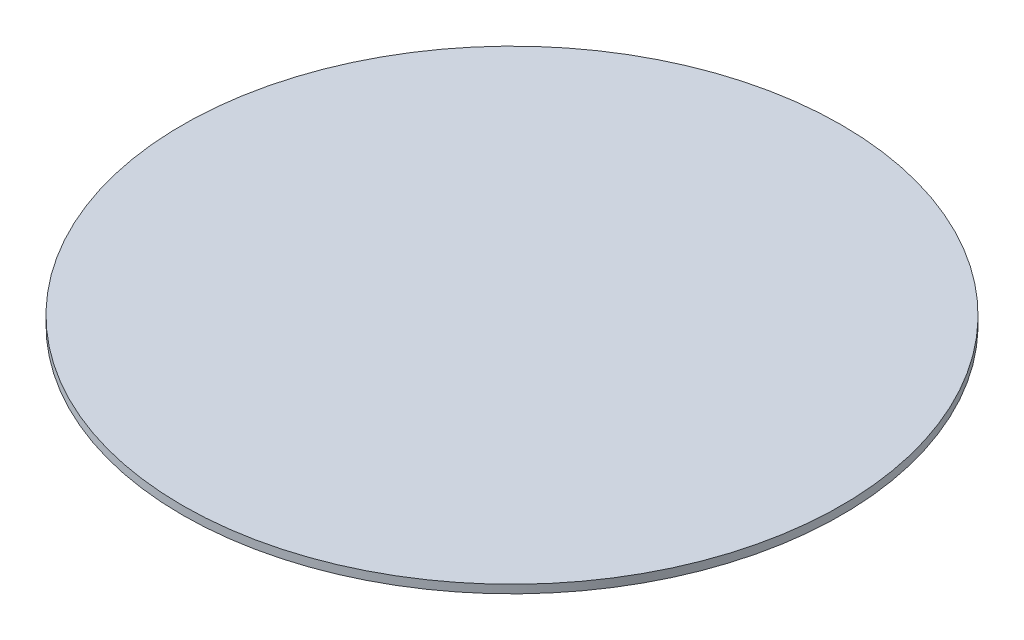
ISO-10303-21;
HEADER;
FILE_DESCRIPTION(('STEP AP214'),'2;1');
FILE_NAME('part.step','',(''),(''),'','','');
FILE_SCHEMA(('AUTOMOTIVE_DESIGN { 1 0 10303 214 1 1 1 1 }'));
ENDSEC;
DATA;
#1=APPLICATION_CONTEXT('core data for automotive mechanical design processes');
#2=APPLICATION_PROTOCOL_DEFINITION('international standard','automotive_design',2000,#1);
#3=PRODUCT_CONTEXT('',#1,'mechanical');
#4=PRODUCT('Part','Part','',(#3));
#5=PRODUCT_RELATED_PRODUCT_CATEGORY('part','',(#4));
#6=PRODUCT_DEFINITION_FORMATION('','',#4);
#7=PRODUCT_DEFINITION_CONTEXT('part definition',#1,'design');
#8=PRODUCT_DEFINITION('design','',#6,#7);
#9=PRODUCT_DEFINITION_SHAPE('','',#8);
#10=(LENGTH_UNIT() NAMED_UNIT(*) SI_UNIT(.MILLI.,.METRE.));
#11=(NAMED_UNIT(*) PLANE_ANGLE_UNIT() SI_UNIT($,.RADIAN.));
#12=(NAMED_UNIT(*) SI_UNIT($,.STERADIAN.) SOLID_ANGLE_UNIT());
#13=UNCERTAINTY_MEASURE_WITH_UNIT(LENGTH_MEASURE(1.E-05),#10,'distance_accuracy_value','');
#14=(GEOMETRIC_REPRESENTATION_CONTEXT(3) GLOBAL_UNCERTAINTY_ASSIGNED_CONTEXT((#13)) GLOBAL_UNIT_ASSIGNED_CONTEXT((#10,
#11,#12)) REPRESENTATION_CONTEXT('',''));
#15=CARTESIAN_POINT('',(0.,0.,0.));
#16=DIRECTION('',(0.,0.,1.));
#17=DIRECTION('',(1.,0.,0.));
#18=AXIS2_PLACEMENT_3D('',#15,#16,#17);
#19=CARTESIAN_POINT('',(0.,3.,0.));
#20=DIRECTION('',(0.,-1.,0.));
#21=DIRECTION('',(0.,0.,-1.));
#22=AXIS2_PLACEMENT_3D('',#19,#20,#21);
#23=CYLINDRICAL_SURFACE('',#22,119.);
#24=CARTESIAN_POINT('',(0.,3.,0.));
#25=DIRECTION('',(0.,-1.,0.));
#26=DIRECTION('',(0.,0.,-1.));
#27=AXIS2_PLACEMENT_3D('',#24,#25,#26);
#28=CIRCLE('',#27,119.);
#29=CARTESIAN_POINT('',(0.,3.,-119.));
#30=VERTEX_POINT('',#29);
#31=EDGE_CURVE('E10',#30,#30,#28,.T.);
#32=ORIENTED_EDGE('',*,*,#31,.T.);
#33=EDGE_LOOP('',(#32));
#34=FACE_BOUND('',#33,.T.);
#35=CARTESIAN_POINT('',(0.,0.,0.));
#36=DIRECTION('',(0.,-1.,0.));
#37=DIRECTION('',(0.,0.,-1.));
#38=AXIS2_PLACEMENT_3D('',#35,#36,#37);
#39=CIRCLE('',#38,119.);
#40=CARTESIAN_POINT('',(0.,0.,-119.));
#41=VERTEX_POINT('',#40);
#42=EDGE_CURVE('E38',#41,#41,#39,.T.);
#43=ORIENTED_EDGE('',*,*,#42,.F.);
#44=EDGE_LOOP('',(#43));
#45=FACE_BOUND('',#44,.T.);
#46=ADVANCED_FACE('F32',(#34,#45),#23,.T.);
#47=CARTESIAN_POINT('',(119.,3.,0.));
#48=DIRECTION('',(0.,1.,0.));
#49=DIRECTION('',(0.,0.,1.));
#50=AXIS2_PLACEMENT_3D('',#47,#48,#49);
#51=PLANE('',#50);
#52=ORIENTED_EDGE('',*,*,#31,.F.);
#53=EDGE_LOOP('',(#52));
#54=FACE_BOUND('',#53,.T.);
#55=ADVANCED_FACE('F47',(#54),#51,.T.);
#56=CARTESIAN_POINT('',(0.,0.,0.));
#57=DIRECTION('',(0.,-1.,0.));
#58=DIRECTION('',(0.,0.,-1.));
#59=AXIS2_PLACEMENT_3D('',#56,#57,#58);
#60=PLANE('',#59);
#61=ORIENTED_EDGE('',*,*,#42,.T.);
#62=EDGE_LOOP('',(#61));
#63=FACE_BOUND('',#62,.T.);
#64=ADVANCED_FACE('F44',(#63),#60,.T.);
#65=CLOSED_SHELL('',(#46,#55,#64));
#66=MANIFOLD_SOLID_BREP('B2',#65);
#67=ADVANCED_BREP_SHAPE_REPRESENTATION('',(#18,#66),#14);
#68=SHAPE_DEFINITION_REPRESENTATION(#9,#67);
ENDSEC;
END-ISO-10303-21;
